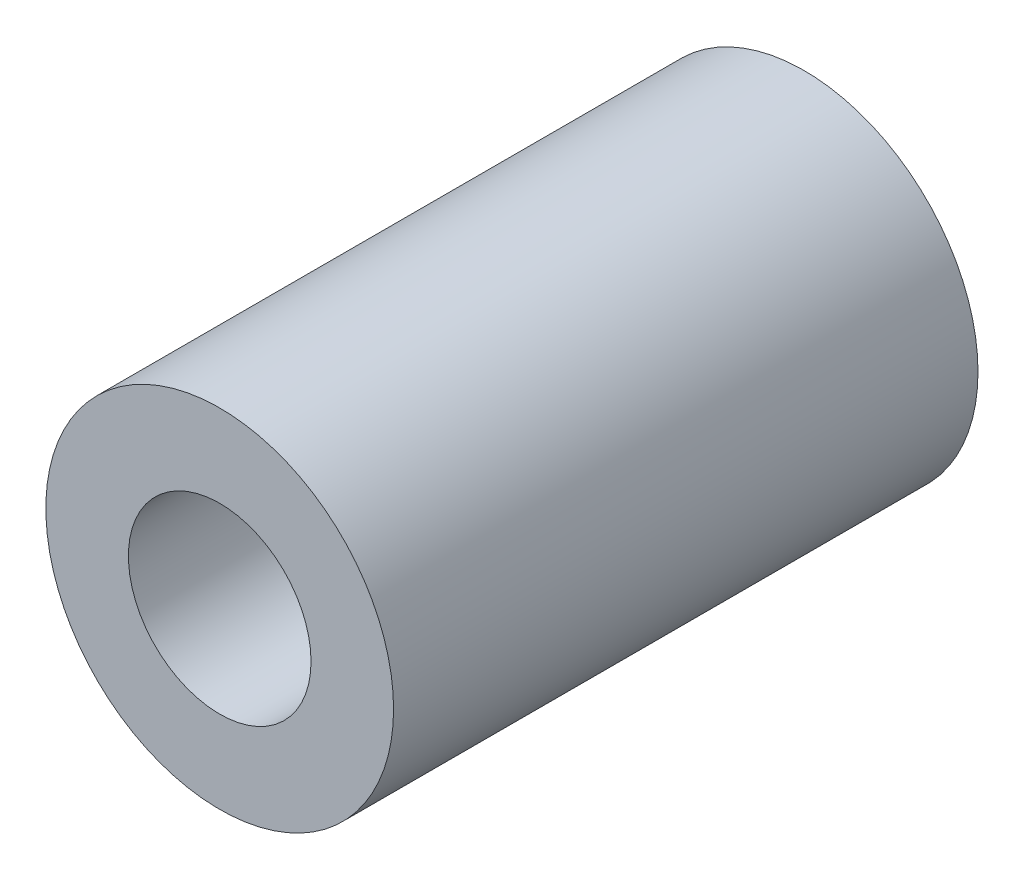
ISO-10303-21;
HEADER;
FILE_DESCRIPTION(('STEP AP214'),'2;1');
FILE_NAME('part.step','',(''),(''),'','','');
FILE_SCHEMA(('AUTOMOTIVE_DESIGN { 1 0 10303 214 1 1 1 1 }'));
ENDSEC;
DATA;
#1=APPLICATION_CONTEXT('core data for automotive mechanical design processes');
#2=APPLICATION_PROTOCOL_DEFINITION('international standard','automotive_design',2000,#1);
#3=PRODUCT_CONTEXT('',#1,'mechanical');
#4=PRODUCT('Part','Part','',(#3));
#5=PRODUCT_RELATED_PRODUCT_CATEGORY('part','',(#4));
#6=PRODUCT_DEFINITION_FORMATION('','',#4);
#7=PRODUCT_DEFINITION_CONTEXT('part definition',#1,'design');
#8=PRODUCT_DEFINITION('design','',#6,#7);
#9=PRODUCT_DEFINITION_SHAPE('','',#8);
#10=(LENGTH_UNIT() NAMED_UNIT(*) SI_UNIT(.MILLI.,.METRE.));
#11=(NAMED_UNIT(*) PLANE_ANGLE_UNIT() SI_UNIT($,.RADIAN.));
#12=(NAMED_UNIT(*) SI_UNIT($,.STERADIAN.) SOLID_ANGLE_UNIT());
#13=UNCERTAINTY_MEASURE_WITH_UNIT(LENGTH_MEASURE(1.E-05),#10,'distance_accuracy_value','');
#14=(GEOMETRIC_REPRESENTATION_CONTEXT(3) GLOBAL_UNCERTAINTY_ASSIGNED_CONTEXT((#13)) GLOBAL_UNIT_ASSIGNED_CONTEXT((#10,
#11,#12)) REPRESENTATION_CONTEXT('',''));
#15=CARTESIAN_POINT('',(0.,0.,0.));
#16=DIRECTION('',(0.,0.,1.));
#17=DIRECTION('',(1.,0.,0.));
#18=AXIS2_PLACEMENT_3D('',#15,#16,#17);
#19=CARTESIAN_POINT('',(0.,0.,8.));
#20=DIRECTION('',(0.,0.,1.));
#21=DIRECTION('',(1.,0.,0.));
#22=AXIS2_PLACEMENT_3D('',#19,#20,#21);
#23=PLANE('',#22);
#24=CARTESIAN_POINT('',(0.,0.,8.));
#25=DIRECTION('',(0.,0.,1.));
#26=DIRECTION('',(1.,0.,0.));
#27=AXIS2_PLACEMENT_3D('',#24,#25,#26);
#28=CIRCLE('',#27,2.38);
#29=CARTESIAN_POINT('',(2.38,0.,8.));
#30=VERTEX_POINT('',#29);
#31=EDGE_CURVE('E10',#30,#30,#28,.T.);
#32=ORIENTED_EDGE('',*,*,#31,.T.);
#33=EDGE_LOOP('',(#32));
#34=FACE_BOUND('',#33,.T.);
#35=CARTESIAN_POINT('',(0.,0.,8.));
#36=DIRECTION('',(0.,0.,1.));
#37=DIRECTION('',(1.,0.,0.));
#38=AXIS2_PLACEMENT_3D('',#35,#36,#37);
#39=CIRCLE('',#38,1.25);
#40=CARTESIAN_POINT('',(1.25,0.,8.));
#41=VERTEX_POINT('',#40);
#42=EDGE_CURVE('E45',#41,#41,#39,.T.);
#43=ORIENTED_EDGE('',*,*,#42,.F.);
#44=EDGE_LOOP('',(#43));
#45=FACE_BOUND('',#44,.T.);
#46=ADVANCED_FACE('F34',(#34,#45),#23,.T.);
#47=CARTESIAN_POINT('',(0.,0.,0.));
#48=DIRECTION('',(0.,0.,1.));
#49=DIRECTION('',(1.,0.,0.));
#50=AXIS2_PLACEMENT_3D('',#47,#48,#49);
#51=PLANE('',#50);
#52=CARTESIAN_POINT('',(0.,0.,0.));
#53=DIRECTION('',(0.,0.,1.));
#54=DIRECTION('',(1.,0.,0.));
#55=AXIS2_PLACEMENT_3D('',#52,#53,#54);
#56=CIRCLE('',#55,2.38);
#57=CARTESIAN_POINT('',(2.38,0.,0.));
#58=VERTEX_POINT('',#57);
#59=EDGE_CURVE('E38',#58,#58,#56,.T.);
#60=ORIENTED_EDGE('',*,*,#59,.F.);
#61=EDGE_LOOP('',(#60));
#62=FACE_BOUND('',#61,.T.);
#63=CARTESIAN_POINT('',(0.,0.,0.));
#64=DIRECTION('',(0.,0.,1.));
#65=DIRECTION('',(1.,0.,0.));
#66=AXIS2_PLACEMENT_3D('',#63,#64,#65);
#67=CIRCLE('',#66,1.25);
#68=CARTESIAN_POINT('',(1.25,0.,0.));
#69=VERTEX_POINT('',#68);
#70=EDGE_CURVE('E47',#69,#69,#67,.T.);
#71=ORIENTED_EDGE('',*,*,#70,.T.);
#72=EDGE_LOOP('',(#71));
#73=FACE_BOUND('',#72,.T.);
#74=ADVANCED_FACE('F57',(#62,#73),#51,.F.);
#75=CARTESIAN_POINT('',(0.,0.,8.));
#76=DIRECTION('',(0.,0.,-1.));
#77=DIRECTION('',(-1.,0.,0.));
#78=AXIS2_PLACEMENT_3D('',#75,#76,#77);
#79=CYLINDRICAL_SURFACE('',#78,2.38);
#80=ORIENTED_EDGE('',*,*,#31,.F.);
#81=EDGE_LOOP('',(#80));
#82=FACE_BOUND('',#81,.T.);
#83=ORIENTED_EDGE('',*,*,#59,.T.);
#84=EDGE_LOOP('',(#83));
#85=FACE_BOUND('',#84,.T.);
#86=ADVANCED_FACE('F36',(#82,#85),#79,.T.);
#87=CARTESIAN_POINT('',(0.,0.,8.));
#88=DIRECTION('',(0.,0.,-1.));
#89=DIRECTION('',(-1.,0.,0.));
#90=AXIS2_PLACEMENT_3D('',#87,#88,#89);
#91=CYLINDRICAL_SURFACE('',#90,1.25);
#92=ORIENTED_EDGE('',*,*,#42,.T.);
#93=EDGE_LOOP('',(#92));
#94=FACE_BOUND('',#93,.T.);
#95=ORIENTED_EDGE('',*,*,#70,.F.);
#96=EDGE_LOOP('',(#95));
#97=FACE_BOUND('',#96,.T.);
#98=ADVANCED_FACE('F53',(#94,#97),#91,.F.);
#99=CLOSED_SHELL('',(#46,#74,#86,#98));
#100=MANIFOLD_SOLID_BREP('B2',#99);
#101=ADVANCED_BREP_SHAPE_REPRESENTATION('',(#18,#100),#14);
#102=SHAPE_DEFINITION_REPRESENTATION(#9,#101);
ENDSEC;
END-ISO-10303-21;
